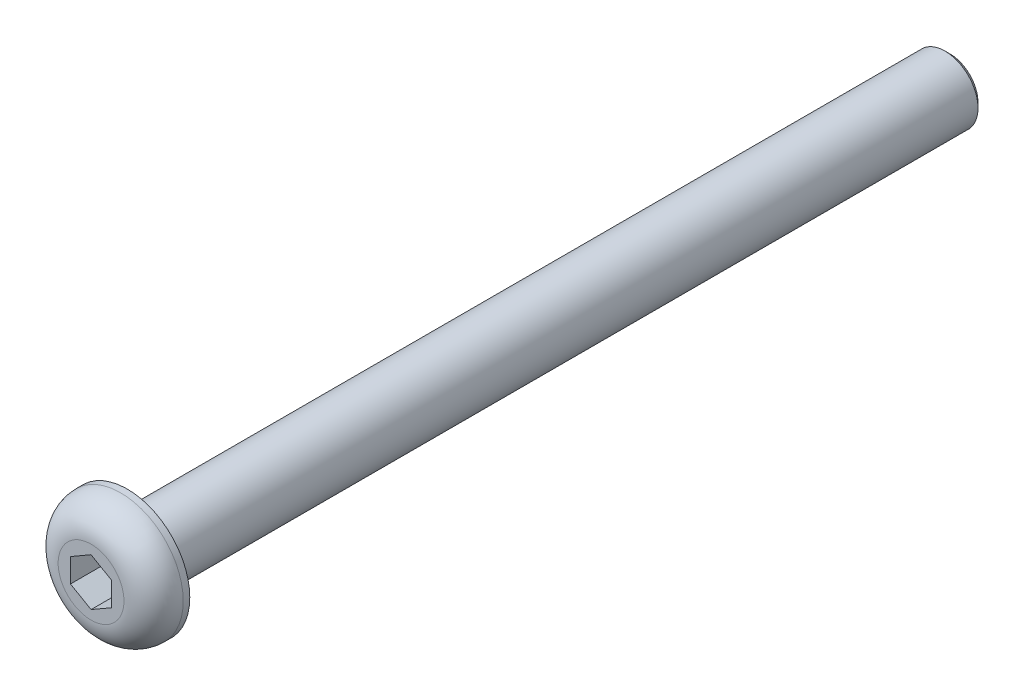
ISO-10303-21;
HEADER;
FILE_DESCRIPTION(('STEP AP214'),'2;1');
FILE_NAME('part.step','',(''),(''),'','','');
FILE_SCHEMA(('AUTOMOTIVE_DESIGN { 1 0 10303 214 1 1 1 1 }'));
ENDSEC;
DATA;
#1=APPLICATION_CONTEXT('core data for automotive mechanical design processes');
#2=APPLICATION_PROTOCOL_DEFINITION('international standard','automotive_design',2000,#1);
#3=PRODUCT_CONTEXT('',#1,'mechanical');
#4=PRODUCT('Part','Part','',(#3));
#5=PRODUCT_RELATED_PRODUCT_CATEGORY('part','',(#4));
#6=PRODUCT_DEFINITION_FORMATION('','',#4);
#7=PRODUCT_DEFINITION_CONTEXT('part definition',#1,'design');
#8=PRODUCT_DEFINITION('design','',#6,#7);
#9=PRODUCT_DEFINITION_SHAPE('','',#8);
#10=(LENGTH_UNIT() NAMED_UNIT(*) SI_UNIT(.MILLI.,.METRE.));
#11=(NAMED_UNIT(*) PLANE_ANGLE_UNIT() SI_UNIT($,.RADIAN.));
#12=(NAMED_UNIT(*) SI_UNIT($,.STERADIAN.) SOLID_ANGLE_UNIT());
#13=UNCERTAINTY_MEASURE_WITH_UNIT(LENGTH_MEASURE(1.E-05),#10,'distance_accuracy_value','');
#14=(GEOMETRIC_REPRESENTATION_CONTEXT(3) GLOBAL_UNCERTAINTY_ASSIGNED_CONTEXT((#13)) GLOBAL_UNIT_ASSIGNED_CONTEXT((#10,
#11,#12)) REPRESENTATION_CONTEXT('',''));
#15=CARTESIAN_POINT('',(0.,0.,0.));
#16=DIRECTION('',(0.,0.,1.));
#17=DIRECTION('',(1.,0.,0.));
#18=AXIS2_PLACEMENT_3D('',#15,#16,#17);
#19=CARTESIAN_POINT('',(0.,0.,0.));
#20=DIRECTION('',(0.,0.,1.));
#21=DIRECTION('',(1.,0.,0.));
#22=AXIS2_PLACEMENT_3D('',#19,#20,#21);
#23=PLANE('',#22);
#24=CARTESIAN_POINT('',(0.,0.,0.));
#25=DIRECTION('',(0.,0.,1.));
#26=DIRECTION('',(1.,0.,0.));
#27=AXIS2_PLACEMENT_3D('',#24,#25,#26);
#28=CIRCLE('',#27,3.8);
#29=CARTESIAN_POINT('',(3.8,0.,0.));
#30=VERTEX_POINT('',#29);
#31=EDGE_CURVE('E139',#30,#30,#28,.T.);
#32=ORIENTED_EDGE('',*,*,#31,.F.);
#33=EDGE_LOOP('',(#32));
#34=FACE_BOUND('',#33,.T.);
#35=CARTESIAN_POINT('',(0.,0.,0.));
#36=DIRECTION('',(0.,0.,1.));
#37=DIRECTION('',(1.,0.,0.));
#38=AXIS2_PLACEMENT_3D('',#35,#36,#37);
#39=CIRCLE('',#38,2.);
#40=CARTESIAN_POINT('',(2.,0.,0.));
#41=VERTEX_POINT('',#40);
#42=EDGE_CURVE('E147',#41,#41,#39,.F.);
#43=ORIENTED_EDGE('',*,*,#42,.F.);
#44=EDGE_LOOP('',(#43));
#45=FACE_BOUND('',#44,.T.);
#46=ADVANCED_FACE('F37',(#34,#45),#23,.F.);
#47=CARTESIAN_POINT('',(0.,0.,2.2));
#48=DIRECTION('',(0.,0.,-1.));
#49=DIRECTION('',(-1.,0.,0.));
#50=AXIS2_PLACEMENT_3D('',#47,#48,#49);
#51=CYLINDRICAL_SURFACE('',#50,3.8);
#52=CARTESIAN_POINT('',(0.,0.,0.4));
#53=DIRECTION('',(0.,0.,1.));
#54=DIRECTION('',(1.,0.,0.));
#55=AXIS2_PLACEMENT_3D('',#52,#53,#54);
#56=CIRCLE('',#55,3.8);
#57=CARTESIAN_POINT('',(3.8,0.,0.4));
#58=VERTEX_POINT('',#57);
#59=EDGE_CURVE('E11',#58,#58,#56,.F.);
#60=ORIENTED_EDGE('',*,*,#59,.T.);
#61=EDGE_LOOP('',(#60));
#62=FACE_BOUND('',#61,.T.);
#63=ORIENTED_EDGE('',*,*,#31,.T.);
#64=EDGE_LOOP('',(#63));
#65=FACE_BOUND('',#64,.T.);
#66=ADVANCED_FACE('F170',(#62,#65),#51,.T.);
#67=CARTESIAN_POINT('',(0.,0.,2.2));
#68=DIRECTION('',(0.,0.,1.));
#69=DIRECTION('',(1.,0.,0.));
#70=AXIS2_PLACEMENT_3D('',#67,#68,#69);
#71=PLANE('',#70);
#72=CARTESIAN_POINT('',(0.,0.,2.2));
#73=DIRECTION('',(0.,0.,1.));
#74=DIRECTION('',(1.,0.,0.));
#75=AXIS2_PLACEMENT_3D('',#72,#73,#74);
#76=CIRCLE('',#75,2.);
#77=CARTESIAN_POINT('',(2.,0.,2.2));
#78=VERTEX_POINT('',#77);
#79=EDGE_CURVE('E45',#78,#78,#76,.T.);
#80=ORIENTED_EDGE('',*,*,#79,.T.);
#81=EDGE_LOOP('',(#80));
#82=FACE_BOUND('',#81,.T.);
#83=DIRECTION('',(-0.866025403784439,0.5,0.));
#84=VECTOR('',#83,1.);
#85=CARTESIAN_POINT('',(1.25,0.721687836487033,2.2));
#86=LINE('',#85,#84);
#87=CARTESIAN_POINT('',(1.25,0.721687836487033,2.2));
#88=VERTEX_POINT('',#87);
#89=CARTESIAN_POINT('',(0.,1.44337567297406,2.2));
#90=VERTEX_POINT('',#89);
#91=EDGE_CURVE('E52',#88,#90,#86,.T.);
#92=ORIENTED_EDGE('',*,*,#91,.F.);
#93=DIRECTION('',(0.,1.,0.));
#94=VECTOR('',#93,1.);
#95=CARTESIAN_POINT('',(1.25,-0.721687836487033,2.2));
#96=LINE('',#95,#94);
#97=CARTESIAN_POINT('',(1.25,-0.721687836487033,2.2));
#98=VERTEX_POINT('',#97);
#99=EDGE_CURVE('E135',#98,#88,#96,.T.);
#100=ORIENTED_EDGE('',*,*,#99,.F.);
#101=DIRECTION('',(0.866025403784439,0.5,0.));
#102=VECTOR('',#101,1.);
#103=CARTESIAN_POINT('',(0.,-1.44337567297406,2.2));
#104=LINE('',#103,#102);
#105=CARTESIAN_POINT('',(0.,-1.44337567297406,2.2));
#106=VERTEX_POINT('',#105);
#107=EDGE_CURVE('E133',#106,#98,#104,.T.);
#108=ORIENTED_EDGE('',*,*,#107,.F.);
#109=DIRECTION('',(0.866025403784439,-0.5,0.));
#110=VECTOR('',#109,1.);
#111=CARTESIAN_POINT('',(-1.25,-0.721687836487032,2.2));
#112=LINE('',#111,#110);
#113=CARTESIAN_POINT('',(-1.25,-0.721687836487032,2.2));
#114=VERTEX_POINT('',#113);
#115=EDGE_CURVE('E100',#114,#106,#112,.T.);
#116=ORIENTED_EDGE('',*,*,#115,.F.);
#117=DIRECTION('',(0.,-1.,0.));
#118=VECTOR('',#117,1.);
#119=CARTESIAN_POINT('',(-1.25,0.721687836487033,2.2));
#120=LINE('',#119,#118);
#121=CARTESIAN_POINT('',(-1.25,0.721687836487033,2.2));
#122=VERTEX_POINT('',#121);
#123=EDGE_CURVE('E129',#122,#114,#120,.T.);
#124=ORIENTED_EDGE('',*,*,#123,.F.);
#125=DIRECTION('',(-0.866025403784439,-0.5,0.));
#126=VECTOR('',#125,1.);
#127=CARTESIAN_POINT('',(0.,1.44337567297406,2.2));
#128=LINE('',#127,#126);
#129=EDGE_CURVE('E126',#90,#122,#128,.T.);
#130=ORIENTED_EDGE('',*,*,#129,.F.);
#131=EDGE_LOOP('',(#92,#100,#108,#116,#124,#130));
#132=FACE_BOUND('',#131,.T.);
#133=ADVANCED_FACE('F158',(#82,#132),#71,.T.);
#134=CARTESIAN_POINT('',(0.,0.,-50.));
#135=DIRECTION('',(0.,0.,1.));
#136=DIRECTION('',(1.,0.,0.));
#137=AXIS2_PLACEMENT_3D('',#134,#135,#136);
#138=CYLINDRICAL_SURFACE('',#137,2.);
#139=CARTESIAN_POINT('',(0.,0.,-49.7));
#140=DIRECTION('',(0.,0.,-1.));
#141=DIRECTION('',(-1.,0.,0.));
#142=AXIS2_PLACEMENT_3D('',#139,#140,#141);
#143=CIRCLE('',#142,2.);
#144=CARTESIAN_POINT('',(-2.,0.,-49.7));
#145=VERTEX_POINT('',#144);
#146=EDGE_CURVE('E153',#145,#145,#143,.F.);
#147=ORIENTED_EDGE('',*,*,#146,.T.);
#148=EDGE_LOOP('',(#147));
#149=FACE_BOUND('',#148,.T.);
#150=ORIENTED_EDGE('',*,*,#42,.T.);
#151=EDGE_LOOP('',(#150));
#152=FACE_BOUND('',#151,.T.);
#153=ADVANCED_FACE('F193',(#149,#152),#138,.T.);
#154=CARTESIAN_POINT('',(0.,0.,-50.));
#155=DIRECTION('',(0.,0.,-1.));
#156=DIRECTION('',(-1.,0.,0.));
#157=AXIS2_PLACEMENT_3D('',#154,#155,#156);
#158=PLANE('',#157);
#159=CARTESIAN_POINT('',(0.,0.,-50.));
#160=DIRECTION('',(0.,0.,-1.));
#161=DIRECTION('',(-1.,0.,0.));
#162=AXIS2_PLACEMENT_3D('',#159,#160,#161);
#163=CIRCLE('',#162,1.7);
#164=CARTESIAN_POINT('',(-1.7,0.,-50.));
#165=VERTEX_POINT('',#164);
#166=EDGE_CURVE('E150',#165,#165,#163,.T.);
#167=ORIENTED_EDGE('',*,*,#166,.T.);
#168=EDGE_LOOP('',(#167));
#169=FACE_BOUND('',#168,.T.);
#170=ADVANCED_FACE('F185',(#169),#158,.T.);
#171=CARTESIAN_POINT('',(0.,0.,-50.));
#172=DIRECTION('',(0.,0.,1.));
#173=DIRECTION('',(1.,0.,0.));
#174=AXIS2_PLACEMENT_3D('',#171,#172,#173);
#175=CONICAL_SURFACE('',#174,1.7,0.785398163397457);
#176=ORIENTED_EDGE('',*,*,#146,.F.);
#177=EDGE_LOOP('',(#176));
#178=FACE_BOUND('',#177,.T.);
#179=ORIENTED_EDGE('',*,*,#166,.F.);
#180=EDGE_LOOP('',(#179));
#181=FACE_BOUND('',#180,.T.);
#182=ADVANCED_FACE('F182',(#178,#181),#175,.T.);
#183=CARTESIAN_POINT('',(1.25,0.721687836487033,0.2));
#184=DIRECTION('',(0.5,0.866025403784439,0.));
#185=DIRECTION('',(-0.866025403784439,0.5,0.));
#186=AXIS2_PLACEMENT_3D('',#183,#184,#185);
#187=PLANE('',#186);
#188=ORIENTED_EDGE('',*,*,#91,.T.);
#189=DIRECTION('',(0.,0.,1.));
#190=VECTOR('',#189,1.);
#191=CARTESIAN_POINT('',(0.,1.44337567297406,0.2));
#192=LINE('',#191,#190);
#193=CARTESIAN_POINT('',(0.,1.44337567297406,0.2));
#194=VERTEX_POINT('',#193);
#195=EDGE_CURVE('E82',#194,#90,#192,.T.);
#196=ORIENTED_EDGE('',*,*,#195,.F.);
#197=DIRECTION('',(-0.866025403784439,0.5,0.));
#198=VECTOR('',#197,1.);
#199=CARTESIAN_POINT('',(1.25,0.721687836487033,0.2));
#200=LINE('',#199,#198);
#201=CARTESIAN_POINT('',(1.25,0.721687836487033,0.2));
#202=VERTEX_POINT('',#201);
#203=EDGE_CURVE('E137',#202,#194,#200,.T.);
#204=ORIENTED_EDGE('',*,*,#203,.F.);
#205=DIRECTION('',(0.,0.,1.));
#206=VECTOR('',#205,1.);
#207=CARTESIAN_POINT('',(1.25,0.721687836487033,0.2));
#208=LINE('',#207,#206);
#209=EDGE_CURVE('E60',#202,#88,#208,.T.);
#210=ORIENTED_EDGE('',*,*,#209,.T.);
#211=EDGE_LOOP('',(#188,#196,#204,#210));
#212=FACE_BOUND('',#211,.T.);
#213=ADVANCED_FACE('F184',(#212),#187,.F.);
#214=CARTESIAN_POINT('',(1.25,-0.721687836487033,0.2));
#215=DIRECTION('',(1.,0.,0.));
#216=DIRECTION('',(0.,1.,0.));
#217=AXIS2_PLACEMENT_3D('',#214,#215,#216);
#218=PLANE('',#217);
#219=ORIENTED_EDGE('',*,*,#99,.T.);
#220=ORIENTED_EDGE('',*,*,#209,.F.);
#221=DIRECTION('',(0.,1.,0.));
#222=VECTOR('',#221,1.);
#223=CARTESIAN_POINT('',(1.25,-0.721687836487033,0.2));
#224=LINE('',#223,#222);
#225=CARTESIAN_POINT('',(1.25,-0.721687836487033,0.2));
#226=VERTEX_POINT('',#225);
#227=EDGE_CURVE('E112',#226,#202,#224,.T.);
#228=ORIENTED_EDGE('',*,*,#227,.F.);
#229=DIRECTION('',(0.,0.,1.));
#230=VECTOR('',#229,1.);
#231=CARTESIAN_POINT('',(1.25,-0.721687836487033,0.2));
#232=LINE('',#231,#230);
#233=EDGE_CURVE('E104',#226,#98,#232,.T.);
#234=ORIENTED_EDGE('',*,*,#233,.T.);
#235=EDGE_LOOP('',(#219,#220,#228,#234));
#236=FACE_BOUND('',#235,.T.);
#237=ADVANCED_FACE('F191',(#236),#218,.F.);
#238=CARTESIAN_POINT('',(0.,-1.44337567297406,0.2));
#239=DIRECTION('',(0.5,-0.866025403784439,0.));
#240=DIRECTION('',(0.866025403784439,0.5,0.));
#241=AXIS2_PLACEMENT_3D('',#238,#239,#240);
#242=PLANE('',#241);
#243=ORIENTED_EDGE('',*,*,#107,.T.);
#244=ORIENTED_EDGE('',*,*,#233,.F.);
#245=DIRECTION('',(0.866025403784439,0.5,0.));
#246=VECTOR('',#245,1.);
#247=CARTESIAN_POINT('',(0.,-1.44337567297406,0.2));
#248=LINE('',#247,#246);
#249=CARTESIAN_POINT('',(0.,-1.44337567297406,0.2));
#250=VERTEX_POINT('',#249);
#251=EDGE_CURVE('E108',#250,#226,#248,.T.);
#252=ORIENTED_EDGE('',*,*,#251,.F.);
#253=DIRECTION('',(0.,0.,1.));
#254=VECTOR('',#253,1.);
#255=CARTESIAN_POINT('',(0.,-1.44337567297406,0.2));
#256=LINE('',#255,#254);
#257=EDGE_CURVE('E93',#250,#106,#256,.T.);
#258=ORIENTED_EDGE('',*,*,#257,.T.);
#259=EDGE_LOOP('',(#243,#244,#252,#258));
#260=FACE_BOUND('',#259,.T.);
#261=ADVANCED_FACE('F109',(#260),#242,.F.);
#262=CARTESIAN_POINT('',(-1.25,-0.721687836487032,0.2));
#263=DIRECTION('',(-0.5,-0.866025403784439,0.));
#264=DIRECTION('',(0.866025403784439,-0.5,0.));
#265=AXIS2_PLACEMENT_3D('',#262,#263,#264);
#266=PLANE('',#265);
#267=ORIENTED_EDGE('',*,*,#115,.T.);
#268=ORIENTED_EDGE('',*,*,#257,.F.);
#269=DIRECTION('',(0.866025403784439,-0.5,0.));
#270=VECTOR('',#269,1.);
#271=CARTESIAN_POINT('',(-1.25,-0.721687836487032,0.2));
#272=LINE('',#271,#270);
#273=CARTESIAN_POINT('',(-1.25,-0.721687836487032,0.2));
#274=VERTEX_POINT('',#273);
#275=EDGE_CURVE('E97',#274,#250,#272,.T.);
#276=ORIENTED_EDGE('',*,*,#275,.F.);
#277=DIRECTION('',(0.,0.,1.));
#278=VECTOR('',#277,1.);
#279=CARTESIAN_POINT('',(-1.25,-0.721687836487032,0.2));
#280=LINE('',#279,#278);
#281=EDGE_CURVE('E105',#274,#114,#280,.T.);
#282=ORIENTED_EDGE('',*,*,#281,.T.);
#283=EDGE_LOOP('',(#267,#268,#276,#282));
#284=FACE_BOUND('',#283,.T.);
#285=ADVANCED_FACE('F95',(#284),#266,.F.);
#286=CARTESIAN_POINT('',(-1.25,0.721687836487033,0.2));
#287=DIRECTION('',(-1.,0.,0.));
#288=DIRECTION('',(0.,0.,1.));
#289=AXIS2_PLACEMENT_3D('',#286,#287,#288);
#290=PLANE('',#289);
#291=ORIENTED_EDGE('',*,*,#123,.T.);
#292=ORIENTED_EDGE('',*,*,#281,.F.);
#293=DIRECTION('',(0.,-1.,0.));
#294=VECTOR('',#293,1.);
#295=CARTESIAN_POINT('',(-1.25,0.721687836487033,0.2));
#296=LINE('',#295,#294);
#297=CARTESIAN_POINT('',(-1.25,0.721687836487033,0.2));
#298=VERTEX_POINT('',#297);
#299=EDGE_CURVE('E118',#298,#274,#296,.T.);
#300=ORIENTED_EDGE('',*,*,#299,.F.);
#301=DIRECTION('',(0.,0.,1.));
#302=VECTOR('',#301,1.);
#303=CARTESIAN_POINT('',(-1.25,0.721687836487033,0.2));
#304=LINE('',#303,#302);
#305=EDGE_CURVE('E142',#298,#122,#304,.T.);
#306=ORIENTED_EDGE('',*,*,#305,.T.);
#307=EDGE_LOOP('',(#291,#292,#300,#306));
#308=FACE_BOUND('',#307,.T.);
#309=ADVANCED_FACE('F209',(#308),#290,.F.);
#310=CARTESIAN_POINT('',(0.,1.44337567297406,0.2));
#311=DIRECTION('',(-0.5,0.866025403784439,0.));
#312=DIRECTION('',(-0.866025403784439,-0.5,0.));
#313=AXIS2_PLACEMENT_3D('',#310,#311,#312);
#314=PLANE('',#313);
#315=ORIENTED_EDGE('',*,*,#129,.T.);
#316=ORIENTED_EDGE('',*,*,#305,.F.);
#317=DIRECTION('',(-0.866025403784439,-0.5,0.));
#318=VECTOR('',#317,1.);
#319=CARTESIAN_POINT('',(0.,1.44337567297406,0.2));
#320=LINE('',#319,#318);
#321=EDGE_CURVE('E120',#194,#298,#320,.T.);
#322=ORIENTED_EDGE('',*,*,#321,.F.);
#323=ORIENTED_EDGE('',*,*,#195,.T.);
#324=EDGE_LOOP('',(#315,#316,#322,#323));
#325=FACE_BOUND('',#324,.T.);
#326=ADVANCED_FACE('F166',(#325),#314,.F.);
#327=CARTESIAN_POINT('',(0.,0.,0.2));
#328=DIRECTION('',(0.,0.,1.));
#329=DIRECTION('',(1.,0.,0.));
#330=AXIS2_PLACEMENT_3D('',#327,#328,#329);
#331=PLANE('',#330);
#332=ORIENTED_EDGE('',*,*,#203,.T.);
#333=ORIENTED_EDGE('',*,*,#321,.T.);
#334=ORIENTED_EDGE('',*,*,#299,.T.);
#335=ORIENTED_EDGE('',*,*,#275,.T.);
#336=ORIENTED_EDGE('',*,*,#251,.T.);
#337=ORIENTED_EDGE('',*,*,#227,.T.);
#338=EDGE_LOOP('',(#332,#333,#334,#335,#336,#337));
#339=FACE_BOUND('',#338,.T.);
#340=ADVANCED_FACE('F115',(#339),#331,.T.);
#341=CARTESIAN_POINT('',(0.,0.,0.4));
#342=DIRECTION('',(0.,0.,1.));
#343=DIRECTION('',(1.,0.,0.));
#344=AXIS2_PLACEMENT_3D('',#341,#342,#343);
#345=TOROIDAL_SURFACE('',#344,2.,1.8);
#346=ORIENTED_EDGE('',*,*,#59,.F.);
#347=EDGE_LOOP('',(#346));
#348=FACE_BOUND('',#347,.T.);
#349=ORIENTED_EDGE('',*,*,#79,.F.);
#350=EDGE_LOOP('',(#349));
#351=FACE_BOUND('',#350,.T.);
#352=ADVANCED_FACE('F39',(#348,#351),#345,.T.);
#353=CLOSED_SHELL('',(#46,#66,#133,#153,#170,#182,#213,#237,#261,#285,#309,#326,#340,#352));
#354=MANIFOLD_SOLID_BREP('B2',#353);
#355=ADVANCED_BREP_SHAPE_REPRESENTATION('',(#18,#354),#14);
#356=SHAPE_DEFINITION_REPRESENTATION(#9,#355);
ENDSEC;
END-ISO-10303-21;
